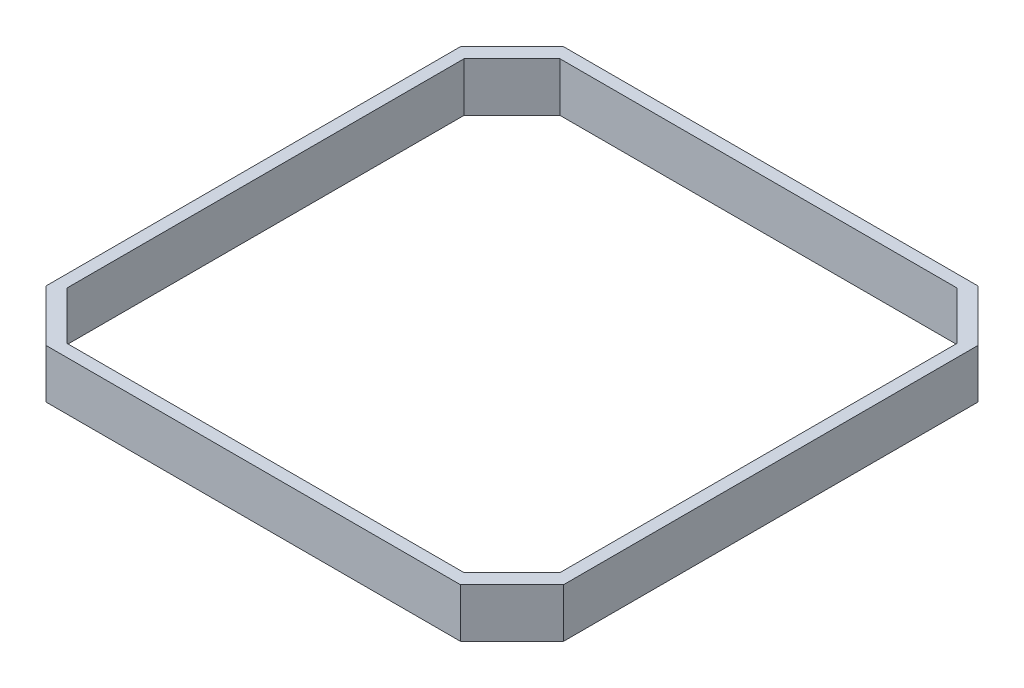
ISO-10303-21;
HEADER;
FILE_DESCRIPTION(('STEP AP214'),'2;1');
FILE_NAME('part.step','',(''),(''),'','','');
FILE_SCHEMA(('AUTOMOTIVE_DESIGN { 1 0 10303 214 1 1 1 1 }'));
ENDSEC;
DATA;
#1=APPLICATION_CONTEXT('core data for automotive mechanical design processes');
#2=APPLICATION_PROTOCOL_DEFINITION('international standard','automotive_design',2000,#1);
#3=PRODUCT_CONTEXT('',#1,'mechanical');
#4=PRODUCT('Part','Part','',(#3));
#5=PRODUCT_RELATED_PRODUCT_CATEGORY('part','',(#4));
#6=PRODUCT_DEFINITION_FORMATION('','',#4);
#7=PRODUCT_DEFINITION_CONTEXT('part definition',#1,'design');
#8=PRODUCT_DEFINITION('design','',#6,#7);
#9=PRODUCT_DEFINITION_SHAPE('','',#8);
#10=(LENGTH_UNIT() NAMED_UNIT(*) SI_UNIT(.MILLI.,.METRE.));
#11=(NAMED_UNIT(*) PLANE_ANGLE_UNIT() SI_UNIT($,.RADIAN.));
#12=(NAMED_UNIT(*) SI_UNIT($,.STERADIAN.) SOLID_ANGLE_UNIT());
#13=UNCERTAINTY_MEASURE_WITH_UNIT(LENGTH_MEASURE(1.E-05),#10,'distance_accuracy_value','');
#14=(GEOMETRIC_REPRESENTATION_CONTEXT(3) GLOBAL_UNCERTAINTY_ASSIGNED_CONTEXT((#13)) GLOBAL_UNIT_ASSIGNED_CONTEXT((#10,
#11,#12)) REPRESENTATION_CONTEXT('',''));
#15=CARTESIAN_POINT('',(0.,0.,0.));
#16=DIRECTION('',(0.,0.,1.));
#17=DIRECTION('',(1.,0.,0.));
#18=AXIS2_PLACEMENT_3D('',#15,#16,#17);
#19=CARTESIAN_POINT('',(0.,4.,0.));
#20=DIRECTION('',(0.,1.,0.));
#21=DIRECTION('',(0.,0.,1.));
#22=AXIS2_PLACEMENT_3D('',#19,#20,#21);
#23=PLANE('',#22);
#24=DIRECTION('',(0.,0.,1.));
#25=VECTOR('',#24,1.);
#26=CARTESIAN_POINT('',(-1.,4.,1.));
#27=LINE('',#26,#25);
#28=CARTESIAN_POINT('',(-1.,4.,-37.));
#29=VERTEX_POINT('',#28);
#30=CARTESIAN_POINT('',(-1.,4.,-3.20000000000002));
#31=VERTEX_POINT('',#30);
#32=EDGE_CURVE('E177',#29,#31,#27,.T.);
#33=ORIENTED_EDGE('',*,*,#32,.T.);
#34=DIRECTION('',(-0.707106781186546,0.,-0.707106781186549));
#35=VECTOR('',#34,1.);
#36=CARTESIAN_POINT('',(1.10000000000001,4.,-1.10000000000001));
#37=LINE('',#36,#35);
#38=CARTESIAN_POINT('',(3.20000000000001,4.,1.));
#39=VERTEX_POINT('',#38);
#40=EDGE_CURVE('E236',#31,#39,#37,.F.);
#41=ORIENTED_EDGE('',*,*,#40,.T.);
#42=DIRECTION('',(1.,0.,0.));
#43=VECTOR('',#42,1.);
#44=CARTESIAN_POINT('',(-1.,4.,1.));
#45=LINE('',#44,#43);
#46=CARTESIAN_POINT('',(37.,4.,1.));
#47=VERTEX_POINT('',#46);
#48=EDGE_CURVE('E265',#39,#47,#45,.T.);
#49=ORIENTED_EDGE('',*,*,#48,.T.);
#50=DIRECTION('',(-0.707106781186549,0.,0.707106781186546));
#51=VECTOR('',#50,1.);
#52=CARTESIAN_POINT('',(18.9999999999999,4.,19.));
#53=LINE('',#52,#51);
#54=CARTESIAN_POINT('',(41.2,4.,-3.20000000000001));
#55=VERTEX_POINT('',#54);
#56=EDGE_CURVE('E234',#47,#55,#53,.F.);
#57=ORIENTED_EDGE('',*,*,#56,.T.);
#58=DIRECTION('',(0.,0.,-1.));
#59=VECTOR('',#58,1.);
#60=CARTESIAN_POINT('',(41.2,4.,1.));
#61=LINE('',#60,#59);
#62=CARTESIAN_POINT('',(41.2,4.,-37.));
#63=VERTEX_POINT('',#62);
#64=EDGE_CURVE('E250',#55,#63,#61,.T.);
#65=ORIENTED_EDGE('',*,*,#64,.T.);
#66=DIRECTION('',(0.707106781186546,0.,0.707106781186549));
#67=VECTOR('',#66,1.);
#68=CARTESIAN_POINT('',(39.1000000000001,4.,-39.0999999999999));
#69=LINE('',#68,#67);
#70=CARTESIAN_POINT('',(37.,4.,-41.2));
#71=VERTEX_POINT('',#70);
#72=EDGE_CURVE('E58',#63,#71,#69,.F.);
#73=ORIENTED_EDGE('',*,*,#72,.T.);
#74=DIRECTION('',(-1.,0.,0.));
#75=VECTOR('',#74,1.);
#76=CARTESIAN_POINT('',(-1.,4.,-41.2));
#77=LINE('',#76,#75);
#78=CARTESIAN_POINT('',(3.20000000000002,4.,-41.2));
#79=VERTEX_POINT('',#78);
#80=EDGE_CURVE('E182',#71,#79,#77,.T.);
#81=ORIENTED_EDGE('',*,*,#80,.T.);
#82=DIRECTION('',(0.707106781186549,0.,-0.707106781186546));
#83=VECTOR('',#82,1.);
#84=CARTESIAN_POINT('',(-19.,4.,-19.0000000000001));
#85=LINE('',#84,#83);
#86=EDGE_CURVE('E231',#79,#29,#85,.F.);
#87=ORIENTED_EDGE('',*,*,#86,.T.);
#88=EDGE_LOOP('',(#33,#41,#49,#57,#65,#73,#81,#87));
#89=FACE_BOUND('',#88,.T.);
#90=DIRECTION('',(1.,0.,0.));
#91=VECTOR('',#90,1.);
#92=CARTESIAN_POINT('',(0.,4.,0.));
#93=LINE('',#92,#91);
#94=CARTESIAN_POINT('',(3.89999999999998,4.,0.));
#95=VERTEX_POINT('',#94);
#96=CARTESIAN_POINT('',(36.3,4.,0.));
#97=VERTEX_POINT('',#96);
#98=EDGE_CURVE('E279',#95,#97,#93,.T.);
#99=ORIENTED_EDGE('',*,*,#98,.F.);
#100=DIRECTION('',(0.707106781186544,0.,0.707106781186551));
#101=VECTOR('',#100,1.);
#102=CARTESIAN_POINT('',(0.,4.,-3.90000000000002));
#103=LINE('',#102,#101);
#104=CARTESIAN_POINT('',(0.,4.,-3.90000000000002));
#105=VERTEX_POINT('',#104);
#106=EDGE_CURVE('E162',#95,#105,#103,.F.);
#107=ORIENTED_EDGE('',*,*,#106,.T.);
#108=DIRECTION('',(0.,0.,1.));
#109=VECTOR('',#108,1.);
#110=CARTESIAN_POINT('',(0.,4.,0.));
#111=LINE('',#110,#109);
#112=CARTESIAN_POINT('',(0.,4.,-36.3));
#113=VERTEX_POINT('',#112);
#114=EDGE_CURVE('E270',#113,#105,#111,.T.);
#115=ORIENTED_EDGE('',*,*,#114,.F.);
#116=DIRECTION('',(-0.707106781186551,0.,0.707106781186544));
#117=VECTOR('',#116,1.);
#118=CARTESIAN_POINT('',(3.90000000000002,4.,-40.2));
#119=LINE('',#118,#117);
#120=CARTESIAN_POINT('',(3.90000000000002,4.,-40.2));
#121=VERTEX_POINT('',#120);
#122=EDGE_CURVE('E211',#113,#121,#119,.F.);
#123=ORIENTED_EDGE('',*,*,#122,.T.);
#124=DIRECTION('',(-1.,0.,0.));
#125=VECTOR('',#124,1.);
#126=CARTESIAN_POINT('',(0.,4.,-40.2));
#127=LINE('',#126,#125);
#128=CARTESIAN_POINT('',(36.3,4.,-40.2));
#129=VERTEX_POINT('',#128);
#130=EDGE_CURVE('E260',#129,#121,#127,.T.);
#131=ORIENTED_EDGE('',*,*,#130,.F.);
#132=DIRECTION('',(-0.707106781186544,0.,-0.707106781186551));
#133=VECTOR('',#132,1.);
#134=CARTESIAN_POINT('',(40.2,4.,-36.3));
#135=LINE('',#134,#133);
#136=CARTESIAN_POINT('',(40.2,4.,-36.3));
#137=VERTEX_POINT('',#136);
#138=EDGE_CURVE('E207',#129,#137,#135,.F.);
#139=ORIENTED_EDGE('',*,*,#138,.T.);
#140=DIRECTION('',(0.,0.,-1.));
#141=VECTOR('',#140,1.);
#142=CARTESIAN_POINT('',(40.2,4.,0.));
#143=LINE('',#142,#141);
#144=CARTESIAN_POINT('',(40.2,4.,-3.89999999999997));
#145=VERTEX_POINT('',#144);
#146=EDGE_CURVE('E276',#145,#137,#143,.T.);
#147=ORIENTED_EDGE('',*,*,#146,.F.);
#148=DIRECTION('',(0.707106781186551,0.,-0.707106781186544));
#149=VECTOR('',#148,1.);
#150=CARTESIAN_POINT('',(36.3,4.,0.));
#151=LINE('',#150,#149);
#152=EDGE_CURVE('E163',#145,#97,#151,.F.);
#153=ORIENTED_EDGE('',*,*,#152,.T.);
#154=EDGE_LOOP('',(#99,#107,#115,#123,#131,#139,#147,#153));
#155=FACE_BOUND('',#154,.T.);
#156=ADVANCED_FACE('F36',(#89,#155),#23,.T.);
#157=CARTESIAN_POINT('',(0.,0.,0.));
#158=DIRECTION('',(0.,1.,0.));
#159=DIRECTION('',(0.,0.,1.));
#160=AXIS2_PLACEMENT_3D('',#157,#158,#159);
#161=PLANE('',#160);
#162=DIRECTION('',(1.,0.,0.));
#163=VECTOR('',#162,1.);
#164=CARTESIAN_POINT('',(-1.,0.,1.));
#165=LINE('',#164,#163);
#166=CARTESIAN_POINT('',(3.20000000000001,0.,1.));
#167=VERTEX_POINT('',#166);
#168=CARTESIAN_POINT('',(37.,0.,1.));
#169=VERTEX_POINT('',#168);
#170=EDGE_CURVE('E258',#167,#169,#165,.T.);
#171=ORIENTED_EDGE('',*,*,#170,.F.);
#172=DIRECTION('',(0.707106781186546,0.,0.707106781186549));
#173=VECTOR('',#172,1.);
#174=CARTESIAN_POINT('',(3.20000000000001,0.,1.));
#175=LINE('',#174,#173);
#176=CARTESIAN_POINT('',(-1.,0.,-3.20000000000002));
#177=VERTEX_POINT('',#176);
#178=EDGE_CURVE('E224',#167,#177,#175,.F.);
#179=ORIENTED_EDGE('',*,*,#178,.T.);
#180=DIRECTION('',(0.,0.,1.));
#181=VECTOR('',#180,1.);
#182=CARTESIAN_POINT('',(-1.,0.,1.));
#183=LINE('',#182,#181);
#184=CARTESIAN_POINT('',(-1.,0.,-37.));
#185=VERTEX_POINT('',#184);
#186=EDGE_CURVE('E185',#185,#177,#183,.T.);
#187=ORIENTED_EDGE('',*,*,#186,.F.);
#188=DIRECTION('',(-0.707106781186549,0.,0.707106781186546));
#189=VECTOR('',#188,1.);
#190=CARTESIAN_POINT('',(-1.,0.,-37.));
#191=LINE('',#190,#189);
#192=CARTESIAN_POINT('',(3.20000000000002,0.,-41.2));
#193=VERTEX_POINT('',#192);
#194=EDGE_CURVE('E218',#185,#193,#191,.F.);
#195=ORIENTED_EDGE('',*,*,#194,.T.);
#196=DIRECTION('',(-1.,0.,0.));
#197=VECTOR('',#196,1.);
#198=CARTESIAN_POINT('',(-1.,0.,-41.2));
#199=LINE('',#198,#197);
#200=CARTESIAN_POINT('',(37.,0.,-41.2));
#201=VERTEX_POINT('',#200);
#202=EDGE_CURVE('E257',#201,#193,#199,.T.);
#203=ORIENTED_EDGE('',*,*,#202,.F.);
#204=DIRECTION('',(-0.707106781186546,0.,-0.707106781186549));
#205=VECTOR('',#204,1.);
#206=CARTESIAN_POINT('',(37.,0.,-41.2));
#207=LINE('',#206,#205);
#208=CARTESIAN_POINT('',(41.2,0.,-37.));
#209=VERTEX_POINT('',#208);
#210=EDGE_CURVE('E220',#201,#209,#207,.F.);
#211=ORIENTED_EDGE('',*,*,#210,.T.);
#212=DIRECTION('',(0.,0.,-1.));
#213=VECTOR('',#212,1.);
#214=CARTESIAN_POINT('',(41.2,0.,1.));
#215=LINE('',#214,#213);
#216=CARTESIAN_POINT('',(41.2,0.,-3.20000000000001));
#217=VERTEX_POINT('',#216);
#218=EDGE_CURVE('E248',#217,#209,#215,.T.);
#219=ORIENTED_EDGE('',*,*,#218,.F.);
#220=DIRECTION('',(0.707106781186549,0.,-0.707106781186546));
#221=VECTOR('',#220,1.);
#222=CARTESIAN_POINT('',(41.2,0.,-3.20000000000001));
#223=LINE('',#222,#221);
#224=EDGE_CURVE('E222',#217,#169,#223,.F.);
#225=ORIENTED_EDGE('',*,*,#224,.T.);
#226=EDGE_LOOP('',(#171,#179,#187,#195,#203,#211,#219,#225));
#227=FACE_BOUND('',#226,.T.);
#228=DIRECTION('',(-1.,0.,0.));
#229=VECTOR('',#228,1.);
#230=CARTESIAN_POINT('',(0.,0.,-40.2));
#231=LINE('',#230,#229);
#232=CARTESIAN_POINT('',(36.3,0.,-40.2));
#233=VERTEX_POINT('',#232);
#234=CARTESIAN_POINT('',(3.90000000000002,0.,-40.2));
#235=VERTEX_POINT('',#234);
#236=EDGE_CURVE('E268',#233,#235,#231,.T.);
#237=ORIENTED_EDGE('',*,*,#236,.T.);
#238=DIRECTION('',(0.707106781186551,0.,-0.707106781186544));
#239=VECTOR('',#238,1.);
#240=CARTESIAN_POINT('',(-18.15,0.,-18.1500000000002));
#241=LINE('',#240,#239);
#242=CARTESIAN_POINT('',(0.,0.,-36.3));
#243=VERTEX_POINT('',#242);
#244=EDGE_CURVE('E209',#235,#243,#241,.F.);
#245=ORIENTED_EDGE('',*,*,#244,.T.);
#246=DIRECTION('',(0.,0.,1.));
#247=VECTOR('',#246,1.);
#248=CARTESIAN_POINT('',(0.,0.,0.));
#249=LINE('',#248,#247);
#250=CARTESIAN_POINT('',(0.,0.,-3.90000000000002));
#251=VERTEX_POINT('',#250);
#252=EDGE_CURVE('E157',#243,#251,#249,.T.);
#253=ORIENTED_EDGE('',*,*,#252,.T.);
#254=DIRECTION('',(-0.707106781186544,0.,-0.707106781186551));
#255=VECTOR('',#254,1.);
#256=CARTESIAN_POINT('',(1.95000000000001,0.,-1.94999999999999));
#257=LINE('',#256,#255);
#258=CARTESIAN_POINT('',(3.89999999999998,0.,0.));
#259=VERTEX_POINT('',#258);
#260=EDGE_CURVE('E151',#251,#259,#257,.F.);
#261=ORIENTED_EDGE('',*,*,#260,.T.);
#262=DIRECTION('',(1.,0.,0.));
#263=VECTOR('',#262,1.);
#264=CARTESIAN_POINT('',(0.,0.,0.));
#265=LINE('',#264,#263);
#266=CARTESIAN_POINT('',(36.3,0.,0.));
#267=VERTEX_POINT('',#266);
#268=EDGE_CURVE('E155',#259,#267,#265,.T.);
#269=ORIENTED_EDGE('',*,*,#268,.T.);
#270=DIRECTION('',(-0.707106781186551,0.,0.707106781186544));
#271=VECTOR('',#270,1.);
#272=CARTESIAN_POINT('',(18.1499999999998,0.,18.15));
#273=LINE('',#272,#271);
#274=CARTESIAN_POINT('',(40.2,0.,-3.89999999999997));
#275=VERTEX_POINT('',#274);
#276=EDGE_CURVE('E201',#267,#275,#273,.F.);
#277=ORIENTED_EDGE('',*,*,#276,.T.);
#278=DIRECTION('',(0.,0.,-1.));
#279=VECTOR('',#278,1.);
#280=CARTESIAN_POINT('',(40.2,0.,0.));
#281=LINE('',#280,#279);
#282=CARTESIAN_POINT('',(40.2,0.,-36.3));
#283=VERTEX_POINT('',#282);
#284=EDGE_CURVE('E173',#275,#283,#281,.T.);
#285=ORIENTED_EDGE('',*,*,#284,.T.);
#286=DIRECTION('',(0.707106781186544,0.,0.707106781186551));
#287=VECTOR('',#286,1.);
#288=CARTESIAN_POINT('',(38.2500000000002,0.,-38.2499999999998));
#289=LINE('',#288,#287);
#290=EDGE_CURVE('E205',#283,#233,#289,.F.);
#291=ORIENTED_EDGE('',*,*,#290,.T.);
#292=EDGE_LOOP('',(#237,#245,#253,#261,#269,#277,#285,#291));
#293=FACE_BOUND('',#292,.T.);
#294=ADVANCED_FACE('F154',(#227,#293),#161,.F.);
#295=CARTESIAN_POINT('',(-1.,4.,1.));
#296=DIRECTION('',(0.,0.,-1.));
#297=DIRECTION('',(-1.,0.,0.));
#298=AXIS2_PLACEMENT_3D('',#295,#296,#297);
#299=PLANE('',#298);
#300=ORIENTED_EDGE('',*,*,#48,.F.);
#301=DIRECTION('',(0.,-1.,0.));
#302=VECTOR('',#301,1.);
#303=CARTESIAN_POINT('',(3.20000000000001,4.,1.));
#304=LINE('',#303,#302);
#305=EDGE_CURVE('E215',#39,#167,#304,.T.);
#306=ORIENTED_EDGE('',*,*,#305,.T.);
#307=ORIENTED_EDGE('',*,*,#170,.T.);
#308=DIRECTION('',(0.,1.,0.));
#309=VECTOR('',#308,1.);
#310=CARTESIAN_POINT('',(37.,4.,1.));
#311=LINE('',#310,#309);
#312=EDGE_CURVE('E213',#169,#47,#311,.T.);
#313=ORIENTED_EDGE('',*,*,#312,.T.);
#314=EDGE_LOOP('',(#300,#306,#307,#313));
#315=FACE_BOUND('',#314,.T.);
#316=ADVANCED_FACE('F323',(#315),#299,.F.);
#317=CARTESIAN_POINT('',(41.2,4.,1.));
#318=DIRECTION('',(-1.,0.,0.));
#319=DIRECTION('',(0.,0.,1.));
#320=AXIS2_PLACEMENT_3D('',#317,#318,#319);
#321=PLANE('',#320);
#322=ORIENTED_EDGE('',*,*,#64,.F.);
#323=DIRECTION('',(0.,-1.,0.));
#324=VECTOR('',#323,1.);
#325=CARTESIAN_POINT('',(41.2,4.,-3.20000000000001));
#326=LINE('',#325,#324);
#327=EDGE_CURVE('E240',#55,#217,#326,.T.);
#328=ORIENTED_EDGE('',*,*,#327,.T.);
#329=ORIENTED_EDGE('',*,*,#218,.T.);
#330=DIRECTION('',(0.,1.,0.));
#331=VECTOR('',#330,1.);
#332=CARTESIAN_POINT('',(41.2,4.,-37.));
#333=LINE('',#332,#331);
#334=EDGE_CURVE('E238',#209,#63,#333,.T.);
#335=ORIENTED_EDGE('',*,*,#334,.T.);
#336=EDGE_LOOP('',(#322,#328,#329,#335));
#337=FACE_BOUND('',#336,.T.);
#338=ADVANCED_FACE('F247',(#337),#321,.F.);
#339=CARTESIAN_POINT('',(-1.,4.,-41.2));
#340=DIRECTION('',(0.,0.,1.));
#341=DIRECTION('',(1.,0.,0.));
#342=AXIS2_PLACEMENT_3D('',#339,#340,#341);
#343=PLANE('',#342);
#344=ORIENTED_EDGE('',*,*,#80,.F.);
#345=DIRECTION('',(0.,-1.,0.));
#346=VECTOR('',#345,1.);
#347=CARTESIAN_POINT('',(37.,4.,-41.2));
#348=LINE('',#347,#346);
#349=EDGE_CURVE('E11',#71,#201,#348,.T.);
#350=ORIENTED_EDGE('',*,*,#349,.T.);
#351=ORIENTED_EDGE('',*,*,#202,.T.);
#352=DIRECTION('',(0.,1.,0.));
#353=VECTOR('',#352,1.);
#354=CARTESIAN_POINT('',(3.20000000000002,4.,-41.2));
#355=LINE('',#354,#353);
#356=EDGE_CURVE('E45',#193,#79,#355,.T.);
#357=ORIENTED_EDGE('',*,*,#356,.T.);
#358=EDGE_LOOP('',(#344,#350,#351,#357));
#359=FACE_BOUND('',#358,.T.);
#360=ADVANCED_FACE('F331',(#359),#343,.F.);
#361=CARTESIAN_POINT('',(-1.,4.,1.));
#362=DIRECTION('',(1.,0.,0.));
#363=DIRECTION('',(0.,0.,-1.));
#364=AXIS2_PLACEMENT_3D('',#361,#362,#363);
#365=PLANE('',#364);
#366=ORIENTED_EDGE('',*,*,#186,.T.);
#367=DIRECTION('',(0.,1.,0.));
#368=VECTOR('',#367,1.);
#369=CARTESIAN_POINT('',(-1.,4.,-3.20000000000002));
#370=LINE('',#369,#368);
#371=EDGE_CURVE('E229',#177,#31,#370,.T.);
#372=ORIENTED_EDGE('',*,*,#371,.T.);
#373=ORIENTED_EDGE('',*,*,#32,.F.);
#374=DIRECTION('',(0.,-1.,0.));
#375=VECTOR('',#374,1.);
#376=CARTESIAN_POINT('',(-1.,4.,-37.));
#377=LINE('',#376,#375);
#378=EDGE_CURVE('E226',#29,#185,#377,.T.);
#379=ORIENTED_EDGE('',*,*,#378,.T.);
#380=EDGE_LOOP('',(#366,#372,#373,#379));
#381=FACE_BOUND('',#380,.T.);
#382=ADVANCED_FACE('F328',(#381),#365,.F.);
#383=CARTESIAN_POINT('',(0.,4.,0.));
#384=DIRECTION('',(1.,0.,0.));
#385=DIRECTION('',(0.,0.,-1.));
#386=AXIS2_PLACEMENT_3D('',#383,#384,#385);
#387=PLANE('',#386);
#388=ORIENTED_EDGE('',*,*,#114,.T.);
#389=DIRECTION('',(0.,-1.,0.));
#390=VECTOR('',#389,1.);
#391=CARTESIAN_POINT('',(0.,0.,-3.90000000000002));
#392=LINE('',#391,#390);
#393=EDGE_CURVE('E194',#105,#251,#392,.T.);
#394=ORIENTED_EDGE('',*,*,#393,.T.);
#395=ORIENTED_EDGE('',*,*,#252,.F.);
#396=DIRECTION('',(0.,1.,0.));
#397=VECTOR('',#396,1.);
#398=CARTESIAN_POINT('',(0.,4.,-36.3));
#399=LINE('',#398,#397);
#400=EDGE_CURVE('E192',#243,#113,#399,.T.);
#401=ORIENTED_EDGE('',*,*,#400,.T.);
#402=EDGE_LOOP('',(#388,#394,#395,#401));
#403=FACE_BOUND('',#402,.T.);
#404=ADVANCED_FACE('F284',(#403),#387,.T.);
#405=CARTESIAN_POINT('',(0.,4.,0.));
#406=DIRECTION('',(0.,0.,-1.));
#407=DIRECTION('',(-1.,0.,0.));
#408=AXIS2_PLACEMENT_3D('',#405,#406,#407);
#409=PLANE('',#408);
#410=ORIENTED_EDGE('',*,*,#98,.T.);
#411=DIRECTION('',(0.,-1.,0.));
#412=VECTOR('',#411,1.);
#413=CARTESIAN_POINT('',(36.3,0.,0.));
#414=LINE('',#413,#412);
#415=EDGE_CURVE('E172',#97,#267,#414,.T.);
#416=ORIENTED_EDGE('',*,*,#415,.T.);
#417=ORIENTED_EDGE('',*,*,#268,.F.);
#418=DIRECTION('',(0.,1.,0.));
#419=VECTOR('',#418,1.);
#420=CARTESIAN_POINT('',(3.89999999999998,4.,0.));
#421=LINE('',#420,#419);
#422=EDGE_CURVE('E169',#259,#95,#421,.T.);
#423=ORIENTED_EDGE('',*,*,#422,.T.);
#424=EDGE_LOOP('',(#410,#416,#417,#423));
#425=FACE_BOUND('',#424,.T.);
#426=ADVANCED_FACE('F168',(#425),#409,.T.);
#427=CARTESIAN_POINT('',(40.2,4.,0.));
#428=DIRECTION('',(-1.,0.,0.));
#429=DIRECTION('',(0.,0.,1.));
#430=AXIS2_PLACEMENT_3D('',#427,#428,#429);
#431=PLANE('',#430);
#432=ORIENTED_EDGE('',*,*,#284,.F.);
#433=DIRECTION('',(0.,1.,0.));
#434=VECTOR('',#433,1.);
#435=CARTESIAN_POINT('',(40.2,4.,-3.89999999999997));
#436=LINE('',#435,#434);
#437=EDGE_CURVE('E190',#275,#145,#436,.T.);
#438=ORIENTED_EDGE('',*,*,#437,.T.);
#439=ORIENTED_EDGE('',*,*,#146,.T.);
#440=DIRECTION('',(0.,-1.,0.));
#441=VECTOR('',#440,1.);
#442=CARTESIAN_POINT('',(40.2,0.,-36.3));
#443=LINE('',#442,#441);
#444=EDGE_CURVE('E179',#137,#283,#443,.T.);
#445=ORIENTED_EDGE('',*,*,#444,.T.);
#446=EDGE_LOOP('',(#432,#438,#439,#445));
#447=FACE_BOUND('',#446,.T.);
#448=ADVANCED_FACE('F302',(#447),#431,.T.);
#449=CARTESIAN_POINT('',(0.,4.,-40.2));
#450=DIRECTION('',(0.,0.,1.));
#451=DIRECTION('',(1.,0.,0.));
#452=AXIS2_PLACEMENT_3D('',#449,#450,#451);
#453=PLANE('',#452);
#454=ORIENTED_EDGE('',*,*,#236,.F.);
#455=DIRECTION('',(0.,1.,0.));
#456=VECTOR('',#455,1.);
#457=CARTESIAN_POINT('',(36.3,4.,-40.2));
#458=LINE('',#457,#456);
#459=EDGE_CURVE('E199',#233,#129,#458,.T.);
#460=ORIENTED_EDGE('',*,*,#459,.T.);
#461=ORIENTED_EDGE('',*,*,#130,.T.);
#462=DIRECTION('',(0.,-1.,0.));
#463=VECTOR('',#462,1.);
#464=CARTESIAN_POINT('',(3.90000000000002,0.,-40.2));
#465=LINE('',#464,#463);
#466=EDGE_CURVE('E196',#121,#235,#465,.T.);
#467=ORIENTED_EDGE('',*,*,#466,.T.);
#468=EDGE_LOOP('',(#454,#460,#461,#467));
#469=FACE_BOUND('',#468,.T.);
#470=ADVANCED_FACE('F294',(#469),#453,.T.);
#471=CARTESIAN_POINT('',(36.3,4.,0.));
#472=DIRECTION('',(-0.707106781186544,0.,-0.707106781186551));
#473=DIRECTION('',(0.,1.,0.));
#474=AXIS2_PLACEMENT_3D('',#471,#472,#473);
#475=PLANE('',#474);
#476=ORIENTED_EDGE('',*,*,#152,.F.);
#477=ORIENTED_EDGE('',*,*,#437,.F.);
#478=ORIENTED_EDGE('',*,*,#276,.F.);
#479=ORIENTED_EDGE('',*,*,#415,.F.);
#480=EDGE_LOOP('',(#476,#477,#478,#479));
#481=FACE_BOUND('',#480,.T.);
#482=ADVANCED_FACE('F307',(#481),#475,.T.);
#483=CARTESIAN_POINT('',(0.,4.,-3.90000000000002));
#484=DIRECTION('',(0.707106781186551,0.,-0.707106781186544));
#485=DIRECTION('',(0.,1.,0.));
#486=AXIS2_PLACEMENT_3D('',#483,#484,#485);
#487=PLANE('',#486);
#488=ORIENTED_EDGE('',*,*,#106,.F.);
#489=ORIENTED_EDGE('',*,*,#422,.F.);
#490=ORIENTED_EDGE('',*,*,#260,.F.);
#491=ORIENTED_EDGE('',*,*,#393,.F.);
#492=EDGE_LOOP('',(#488,#489,#490,#491));
#493=FACE_BOUND('',#492,.T.);
#494=ADVANCED_FACE('F176',(#493),#487,.T.);
#495=CARTESIAN_POINT('',(40.2,4.,-36.3));
#496=DIRECTION('',(-0.707106781186551,0.,0.707106781186544));
#497=DIRECTION('',(0.,1.,0.));
#498=AXIS2_PLACEMENT_3D('',#495,#496,#497);
#499=PLANE('',#498);
#500=ORIENTED_EDGE('',*,*,#138,.F.);
#501=ORIENTED_EDGE('',*,*,#459,.F.);
#502=ORIENTED_EDGE('',*,*,#290,.F.);
#503=ORIENTED_EDGE('',*,*,#444,.F.);
#504=EDGE_LOOP('',(#500,#501,#502,#503));
#505=FACE_BOUND('',#504,.T.);
#506=ADVANCED_FACE('F300',(#505),#499,.T.);
#507=CARTESIAN_POINT('',(3.90000000000002,4.,-40.2));
#508=DIRECTION('',(0.707106781186544,0.,0.707106781186551));
#509=DIRECTION('',(0.,1.,0.));
#510=AXIS2_PLACEMENT_3D('',#507,#508,#509);
#511=PLANE('',#510);
#512=ORIENTED_EDGE('',*,*,#122,.F.);
#513=ORIENTED_EDGE('',*,*,#400,.F.);
#514=ORIENTED_EDGE('',*,*,#244,.F.);
#515=ORIENTED_EDGE('',*,*,#466,.F.);
#516=EDGE_LOOP('',(#512,#513,#514,#515));
#517=FACE_BOUND('',#516,.T.);
#518=ADVANCED_FACE('F291',(#517),#511,.T.);
#519=CARTESIAN_POINT('',(3.20000000000001,4.,1.));
#520=DIRECTION('',(0.707106781186549,0.,-0.707106781186546));
#521=DIRECTION('',(0.,-1.,0.));
#522=AXIS2_PLACEMENT_3D('',#519,#520,#521);
#523=PLANE('',#522);
#524=ORIENTED_EDGE('',*,*,#40,.F.);
#525=ORIENTED_EDGE('',*,*,#371,.F.);
#526=ORIENTED_EDGE('',*,*,#178,.F.);
#527=ORIENTED_EDGE('',*,*,#305,.F.);
#528=EDGE_LOOP('',(#524,#525,#526,#527));
#529=FACE_BOUND('',#528,.T.);
#530=ADVANCED_FACE('F345',(#529),#523,.F.);
#531=CARTESIAN_POINT('',(41.2,4.,-3.20000000000001));
#532=DIRECTION('',(-0.707106781186546,0.,-0.707106781186549));
#533=DIRECTION('',(0.,-1.,0.));
#534=AXIS2_PLACEMENT_3D('',#531,#532,#533);
#535=PLANE('',#534);
#536=ORIENTED_EDGE('',*,*,#56,.F.);
#537=ORIENTED_EDGE('',*,*,#312,.F.);
#538=ORIENTED_EDGE('',*,*,#224,.F.);
#539=ORIENTED_EDGE('',*,*,#327,.F.);
#540=EDGE_LOOP('',(#536,#537,#538,#539));
#541=FACE_BOUND('',#540,.T.);
#542=ADVANCED_FACE('F356',(#541),#535,.F.);
#543=CARTESIAN_POINT('',(37.,4.,-41.2));
#544=DIRECTION('',(-0.707106781186549,0.,0.707106781186546));
#545=DIRECTION('',(0.,-1.,0.));
#546=AXIS2_PLACEMENT_3D('',#543,#544,#545);
#547=PLANE('',#546);
#548=ORIENTED_EDGE('',*,*,#72,.F.);
#549=ORIENTED_EDGE('',*,*,#334,.F.);
#550=ORIENTED_EDGE('',*,*,#210,.F.);
#551=ORIENTED_EDGE('',*,*,#349,.F.);
#552=EDGE_LOOP('',(#548,#549,#550,#551));
#553=FACE_BOUND('',#552,.T.);
#554=ADVANCED_FACE('F355',(#553),#547,.F.);
#555=CARTESIAN_POINT('',(-1.,4.,-37.));
#556=DIRECTION('',(0.707106781186546,0.,0.707106781186549));
#557=DIRECTION('',(0.,-1.,0.));
#558=AXIS2_PLACEMENT_3D('',#555,#556,#557);
#559=PLANE('',#558);
#560=ORIENTED_EDGE('',*,*,#86,.F.);
#561=ORIENTED_EDGE('',*,*,#356,.F.);
#562=ORIENTED_EDGE('',*,*,#194,.F.);
#563=ORIENTED_EDGE('',*,*,#378,.F.);
#564=EDGE_LOOP('',(#560,#561,#562,#563));
#565=FACE_BOUND('',#564,.T.);
#566=ADVANCED_FACE('F39',(#565),#559,.F.);
#567=CLOSED_SHELL('',(#156,#294,#316,#338,#360,#382,#404,#426,#448,#470,#482,#494,#506,#518,
#530,#542,#554,#566));
#568=MANIFOLD_SOLID_BREP('B2',#567);
#569=ADVANCED_BREP_SHAPE_REPRESENTATION('',(#18,#568),#14);
#570=SHAPE_DEFINITION_REPRESENTATION(#9,#569);
ENDSEC;
END-ISO-10303-21;
